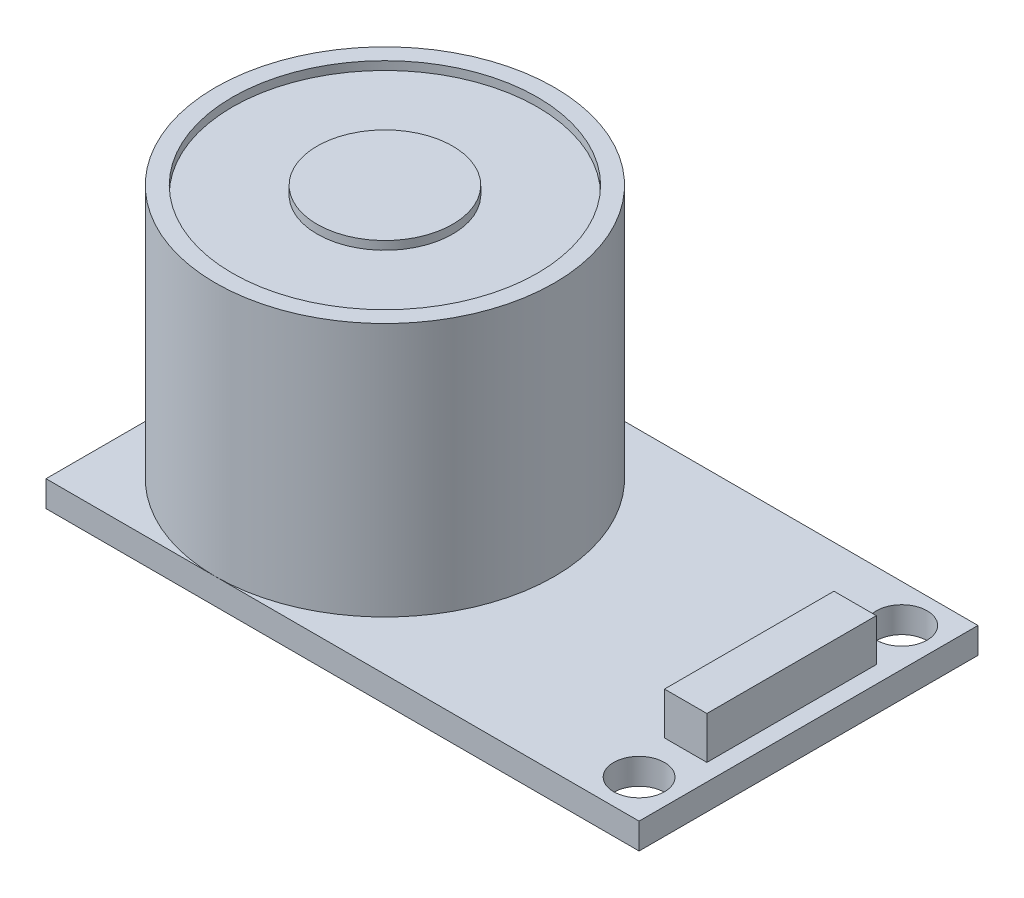
ISO-10303-21;
HEADER;
FILE_DESCRIPTION(('STEP AP214'),'2;1');
FILE_NAME('part.step','',(''),(''),'','','');
FILE_SCHEMA(('AUTOMOTIVE_DESIGN { 1 0 10303 214 1 1 1 1 }'));
ENDSEC;
DATA;
#1=APPLICATION_CONTEXT('core data for automotive mechanical design processes');
#2=APPLICATION_PROTOCOL_DEFINITION('international standard','automotive_design',2000,#1);
#3=PRODUCT_CONTEXT('',#1,'mechanical');
#4=PRODUCT('Part','Part','',(#3));
#5=PRODUCT_RELATED_PRODUCT_CATEGORY('part','',(#4));
#6=PRODUCT_DEFINITION_FORMATION('','',#4);
#7=PRODUCT_DEFINITION_CONTEXT('part definition',#1,'design');
#8=PRODUCT_DEFINITION('design','',#6,#7);
#9=PRODUCT_DEFINITION_SHAPE('','',#8);
#10=(LENGTH_UNIT() NAMED_UNIT(*) SI_UNIT(.MILLI.,.METRE.));
#11=(NAMED_UNIT(*) PLANE_ANGLE_UNIT() SI_UNIT($,.RADIAN.));
#12=(NAMED_UNIT(*) SI_UNIT($,.STERADIAN.) SOLID_ANGLE_UNIT());
#13=UNCERTAINTY_MEASURE_WITH_UNIT(LENGTH_MEASURE(1.E-05),#10,'distance_accuracy_value','');
#14=(GEOMETRIC_REPRESENTATION_CONTEXT(3) GLOBAL_UNCERTAINTY_ASSIGNED_CONTEXT((#13)) GLOBAL_UNIT_ASSIGNED_CONTEXT((#10,
#11,#12)) REPRESENTATION_CONTEXT('',''));
#15=CARTESIAN_POINT('',(0.,0.,0.));
#16=DIRECTION('',(0.,0.,1.));
#17=DIRECTION('',(1.,0.,0.));
#18=AXIS2_PLACEMENT_3D('',#15,#16,#17);
#19=CARTESIAN_POINT('',(0.,1.53,0.));
#20=DIRECTION('',(0.,-1.,0.));
#21=DIRECTION('',(0.,0.,-1.));
#22=AXIS2_PLACEMENT_3D('',#19,#20,#21);
#23=PLANE('',#22);
#24=CARTESIAN_POINT('',(32.75,1.53,-2.25));
#25=DIRECTION('',(0.,1.,0.));
#26=DIRECTION('',(0.,0.,-1.));
#27=AXIS2_PLACEMENT_3D('',#24,#25,#26);
#28=CIRCLE('',#27,1.5);
#29=CARTESIAN_POINT('',(32.75,1.53,-3.75));
#30=VERTEX_POINT('',#29);
#31=EDGE_CURVE('E171',#30,#30,#28,.T.);
#32=ORIENTED_EDGE('',*,*,#31,.F.);
#33=EDGE_LOOP('',(#32));
#34=FACE_BOUND('',#33,.T.);
#35=CARTESIAN_POINT('',(32.75,1.53,-17.75));
#36=DIRECTION('',(0.,1.,0.));
#37=DIRECTION('',(0.,0.,1.));
#38=AXIS2_PLACEMENT_3D('',#35,#36,#37);
#39=CIRCLE('',#38,1.5);
#40=CARTESIAN_POINT('',(32.75,1.53,-16.25));
#41=VERTEX_POINT('',#40);
#42=EDGE_CURVE('E177',#41,#41,#39,.T.);
#43=ORIENTED_EDGE('',*,*,#42,.F.);
#44=EDGE_LOOP('',(#43));
#45=FACE_BOUND('',#44,.T.);
#46=CARTESIAN_POINT('',(10.,1.53,-10.));
#47=DIRECTION('',(0.,1.,0.));
#48=DIRECTION('',(0.,0.,1.));
#49=AXIS2_PLACEMENT_3D('',#46,#47,#48);
#50=CIRCLE('',#49,10.);
#51=CARTESIAN_POINT('',(10.,1.53,0.));
#52=VERTEX_POINT('',#51);
#53=CARTESIAN_POINT('',(10.,1.53,-20.));
#54=VERTEX_POINT('',#53);
#55=EDGE_CURVE('E62',#52,#54,#50,.T.);
#56=ORIENTED_EDGE('',*,*,#55,.F.);
#57=DIRECTION('',(1.,0.,0.));
#58=VECTOR('',#57,1.);
#59=CARTESIAN_POINT('',(0.,1.53,0.));
#60=LINE('',#59,#58);
#61=CARTESIAN_POINT('',(35.,1.53,0.));
#62=VERTEX_POINT('',#61);
#63=EDGE_CURVE('E186',#52,#62,#60,.T.);
#64=ORIENTED_EDGE('',*,*,#63,.T.);
#65=DIRECTION('',(0.,0.,-1.));
#66=VECTOR('',#65,1.);
#67=CARTESIAN_POINT('',(35.,1.53,0.));
#68=LINE('',#67,#66);
#69=CARTESIAN_POINT('',(35.,1.53,-20.));
#70=VERTEX_POINT('',#69);
#71=EDGE_CURVE('E190',#62,#70,#68,.T.);
#72=ORIENTED_EDGE('',*,*,#71,.T.);
#73=DIRECTION('',(-1.,0.,0.));
#74=VECTOR('',#73,1.);
#75=CARTESIAN_POINT('',(0.,1.53,-20.));
#76=LINE('',#75,#74);
#77=EDGE_CURVE('E193',#70,#54,#76,.T.);
#78=ORIENTED_EDGE('',*,*,#77,.T.);
#79=EDGE_LOOP('',(#56,#64,#72,#78));
#80=FACE_BOUND('',#79,.T.);
#81=DIRECTION('',(0.,0.,-1.));
#82=VECTOR('',#81,1.);
#83=CARTESIAN_POINT('',(34.,1.53,-5.));
#84=LINE('',#83,#82);
#85=CARTESIAN_POINT('',(34.,1.53,-5.));
#86=VERTEX_POINT('',#85);
#87=CARTESIAN_POINT('',(34.,1.53,-15.));
#88=VERTEX_POINT('',#87);
#89=EDGE_CURVE('E148',#86,#88,#84,.T.);
#90=ORIENTED_EDGE('',*,*,#89,.F.);
#91=DIRECTION('',(1.,0.,0.));
#92=VECTOR('',#91,1.);
#93=CARTESIAN_POINT('',(31.5,1.53,-5.));
#94=LINE('',#93,#92);
#95=CARTESIAN_POINT('',(31.5,1.53,-5.));
#96=VERTEX_POINT('',#95);
#97=EDGE_CURVE('E145',#96,#86,#94,.T.);
#98=ORIENTED_EDGE('',*,*,#97,.F.);
#99=DIRECTION('',(0.,0.,1.));
#100=VECTOR('',#99,1.);
#101=CARTESIAN_POINT('',(31.5,1.53,-5.));
#102=LINE('',#101,#100);
#103=CARTESIAN_POINT('',(31.5,1.53,-15.));
#104=VERTEX_POINT('',#103);
#105=EDGE_CURVE('E74',#104,#96,#102,.T.);
#106=ORIENTED_EDGE('',*,*,#105,.F.);
#107=DIRECTION('',(-1.,0.,0.));
#108=VECTOR('',#107,1.);
#109=CARTESIAN_POINT('',(31.5,1.53,-15.));
#110=LINE('',#109,#108);
#111=EDGE_CURVE('E69',#88,#104,#110,.T.);
#112=ORIENTED_EDGE('',*,*,#111,.F.);
#113=EDGE_LOOP('',(#90,#98,#106,#112));
#114=FACE_BOUND('',#113,.T.);
#115=ADVANCED_FACE('F51',(#34,#45,#80,#114),#23,.F.);
#116=CARTESIAN_POINT('',(0.,1.53,-10.));
#117=VERTEX_POINT('',#116);
#118=EDGE_CURVE('E11',#54,#117,#50,.T.);
#119=ORIENTED_EDGE('',*,*,#118,.F.);
#120=CARTESIAN_POINT('',(0.,1.53,-20.));
#121=VERTEX_POINT('',#120);
#122=EDGE_CURVE('E192',#54,#121,#76,.T.);
#123=ORIENTED_EDGE('',*,*,#122,.T.);
#124=DIRECTION('',(0.,0.,1.));
#125=VECTOR('',#124,1.);
#126=CARTESIAN_POINT('',(0.,1.53,0.));
#127=LINE('',#126,#125);
#128=EDGE_CURVE('E183',#121,#117,#127,.T.);
#129=ORIENTED_EDGE('',*,*,#128,.T.);
#130=EDGE_LOOP('',(#119,#123,#129));
#131=FACE_BOUND('',#130,.T.);
#132=ADVANCED_FACE('F230',(#131),#23,.F.);
#133=EDGE_CURVE('E60',#117,#52,#50,.T.);
#134=ORIENTED_EDGE('',*,*,#133,.F.);
#135=CARTESIAN_POINT('',(0.,1.53,0.));
#136=VERTEX_POINT('',#135);
#137=EDGE_CURVE('E187',#117,#136,#127,.T.);
#138=ORIENTED_EDGE('',*,*,#137,.T.);
#139=EDGE_CURVE('E188',#136,#52,#60,.T.);
#140=ORIENTED_EDGE('',*,*,#139,.T.);
#141=EDGE_LOOP('',(#134,#138,#140));
#142=FACE_BOUND('',#141,.T.);
#143=ADVANCED_FACE('F225',(#142),#23,.F.);
#144=CARTESIAN_POINT('',(0.,0.,0.));
#145=DIRECTION('',(0.,-1.,0.));
#146=DIRECTION('',(0.,0.,-1.));
#147=AXIS2_PLACEMENT_3D('',#144,#145,#146);
#148=PLANE('',#147);
#149=CARTESIAN_POINT('',(32.75,0.,-17.75));
#150=DIRECTION('',(0.,1.,0.));
#151=DIRECTION('',(0.,0.,1.));
#152=AXIS2_PLACEMENT_3D('',#149,#150,#151);
#153=CIRCLE('',#152,1.5);
#154=CARTESIAN_POINT('',(32.75,0.,-16.25));
#155=VERTEX_POINT('',#154);
#156=EDGE_CURVE('E174',#155,#155,#153,.T.);
#157=ORIENTED_EDGE('',*,*,#156,.T.);
#158=EDGE_LOOP('',(#157));
#159=FACE_BOUND('',#158,.T.);
#160=DIRECTION('',(0.,0.,1.));
#161=VECTOR('',#160,1.);
#162=CARTESIAN_POINT('',(0.,0.,0.));
#163=LINE('',#162,#161);
#164=CARTESIAN_POINT('',(0.,0.,-20.));
#165=VERTEX_POINT('',#164);
#166=CARTESIAN_POINT('',(0.,0.,0.));
#167=VERTEX_POINT('',#166);
#168=EDGE_CURVE('E180',#165,#167,#163,.T.);
#169=ORIENTED_EDGE('',*,*,#168,.F.);
#170=DIRECTION('',(-1.,0.,0.));
#171=VECTOR('',#170,1.);
#172=CARTESIAN_POINT('',(0.,0.,-20.));
#173=LINE('',#172,#171);
#174=CARTESIAN_POINT('',(35.,0.,-20.));
#175=VERTEX_POINT('',#174);
#176=EDGE_CURVE('E203',#175,#165,#173,.T.);
#177=ORIENTED_EDGE('',*,*,#176,.F.);
#178=DIRECTION('',(0.,0.,-1.));
#179=VECTOR('',#178,1.);
#180=CARTESIAN_POINT('',(35.,0.,0.));
#181=LINE('',#180,#179);
#182=CARTESIAN_POINT('',(35.,0.,0.));
#183=VERTEX_POINT('',#182);
#184=EDGE_CURVE('E201',#183,#175,#181,.T.);
#185=ORIENTED_EDGE('',*,*,#184,.F.);
#186=DIRECTION('',(1.,0.,0.));
#187=VECTOR('',#186,1.);
#188=CARTESIAN_POINT('',(0.,0.,0.));
#189=LINE('',#188,#187);
#190=EDGE_CURVE('E199',#167,#183,#189,.T.);
#191=ORIENTED_EDGE('',*,*,#190,.F.);
#192=EDGE_LOOP('',(#169,#177,#185,#191));
#193=FACE_BOUND('',#192,.T.);
#194=CARTESIAN_POINT('',(32.75,0.,-2.25));
#195=DIRECTION('',(0.,1.,0.));
#196=DIRECTION('',(0.,0.,-1.));
#197=AXIS2_PLACEMENT_3D('',#194,#195,#196);
#198=CIRCLE('',#197,1.5);
#199=CARTESIAN_POINT('',(32.75,0.,-3.75));
#200=VERTEX_POINT('',#199);
#201=EDGE_CURVE('E168',#200,#200,#198,.T.);
#202=ORIENTED_EDGE('',*,*,#201,.T.);
#203=EDGE_LOOP('',(#202));
#204=FACE_BOUND('',#203,.T.);
#205=ADVANCED_FACE('F239',(#159,#193,#204),#148,.T.);
#206=CARTESIAN_POINT('',(0.,1.53,0.));
#207=DIRECTION('',(1.,0.,0.));
#208=DIRECTION('',(0.,0.,-1.));
#209=AXIS2_PLACEMENT_3D('',#206,#207,#208);
#210=PLANE('',#209);
#211=ORIENTED_EDGE('',*,*,#168,.T.);
#212=DIRECTION('',(0.,-1.,0.));
#213=VECTOR('',#212,1.);
#214=CARTESIAN_POINT('',(0.,1.53,0.));
#215=LINE('',#214,#213);
#216=EDGE_CURVE('E55',#136,#167,#215,.T.);
#217=ORIENTED_EDGE('',*,*,#216,.F.);
#218=ORIENTED_EDGE('',*,*,#137,.F.);
#219=ORIENTED_EDGE('',*,*,#128,.F.);
#220=DIRECTION('',(0.,-1.,0.));
#221=VECTOR('',#220,1.);
#222=CARTESIAN_POINT('',(0.,1.53,-20.));
#223=LINE('',#222,#221);
#224=EDGE_CURVE('E196',#121,#165,#223,.T.);
#225=ORIENTED_EDGE('',*,*,#224,.T.);
#226=EDGE_LOOP('',(#211,#217,#218,#219,#225));
#227=FACE_BOUND('',#226,.T.);
#228=ADVANCED_FACE('F53',(#227),#210,.F.);
#229=CARTESIAN_POINT('',(0.,1.53,0.));
#230=DIRECTION('',(0.,0.,-1.));
#231=DIRECTION('',(-1.,0.,0.));
#232=AXIS2_PLACEMENT_3D('',#229,#230,#231);
#233=PLANE('',#232);
#234=ORIENTED_EDGE('',*,*,#190,.T.);
#235=DIRECTION('',(0.,-1.,0.));
#236=VECTOR('',#235,1.);
#237=CARTESIAN_POINT('',(35.,1.53,0.));
#238=LINE('',#237,#236);
#239=EDGE_CURVE('E209',#62,#183,#238,.T.);
#240=ORIENTED_EDGE('',*,*,#239,.F.);
#241=ORIENTED_EDGE('',*,*,#63,.F.);
#242=ORIENTED_EDGE('',*,*,#139,.F.);
#243=ORIENTED_EDGE('',*,*,#216,.T.);
#244=EDGE_LOOP('',(#234,#240,#241,#242,#243));
#245=FACE_BOUND('',#244,.T.);
#246=ADVANCED_FACE('F241',(#245),#233,.F.);
#247=CARTESIAN_POINT('',(35.,1.53,0.));
#248=DIRECTION('',(-1.,0.,0.));
#249=DIRECTION('',(0.,0.,1.));
#250=AXIS2_PLACEMENT_3D('',#247,#248,#249);
#251=PLANE('',#250);
#252=ORIENTED_EDGE('',*,*,#184,.T.);
#253=DIRECTION('',(0.,-1.,0.));
#254=VECTOR('',#253,1.);
#255=CARTESIAN_POINT('',(35.,1.53,-20.));
#256=LINE('',#255,#254);
#257=EDGE_CURVE('E207',#70,#175,#256,.T.);
#258=ORIENTED_EDGE('',*,*,#257,.F.);
#259=ORIENTED_EDGE('',*,*,#71,.F.);
#260=ORIENTED_EDGE('',*,*,#239,.T.);
#261=EDGE_LOOP('',(#252,#258,#259,#260));
#262=FACE_BOUND('',#261,.T.);
#263=ADVANCED_FACE('F243',(#262),#251,.F.);
#264=CARTESIAN_POINT('',(0.,1.53,-20.));
#265=DIRECTION('',(0.,0.,1.));
#266=DIRECTION('',(1.,0.,0.));
#267=AXIS2_PLACEMENT_3D('',#264,#265,#266);
#268=PLANE('',#267);
#269=ORIENTED_EDGE('',*,*,#176,.T.);
#270=ORIENTED_EDGE('',*,*,#224,.F.);
#271=ORIENTED_EDGE('',*,*,#122,.F.);
#272=ORIENTED_EDGE('',*,*,#77,.F.);
#273=ORIENTED_EDGE('',*,*,#257,.T.);
#274=EDGE_LOOP('',(#269,#270,#271,#272,#273));
#275=FACE_BOUND('',#274,.T.);
#276=ADVANCED_FACE('F235',(#275),#268,.F.);
#277=CARTESIAN_POINT('',(32.75,1.53,-17.75));
#278=DIRECTION('',(0.,-1.,0.));
#279=DIRECTION('',(0.,0.,-1.));
#280=AXIS2_PLACEMENT_3D('',#277,#278,#279);
#281=CYLINDRICAL_SURFACE('',#280,1.5);
#282=ORIENTED_EDGE('',*,*,#42,.T.);
#283=EDGE_LOOP('',(#282));
#284=FACE_BOUND('',#283,.T.);
#285=ORIENTED_EDGE('',*,*,#156,.F.);
#286=EDGE_LOOP('',(#285));
#287=FACE_BOUND('',#286,.T.);
#288=ADVANCED_FACE('F298',(#284,#287),#281,.F.);
#289=CARTESIAN_POINT('',(32.75,1.53,-2.25));
#290=DIRECTION('',(0.,-1.,0.));
#291=DIRECTION('',(0.,0.,-1.));
#292=AXIS2_PLACEMENT_3D('',#289,#290,#291);
#293=CYLINDRICAL_SURFACE('',#292,1.5);
#294=ORIENTED_EDGE('',*,*,#31,.T.);
#295=EDGE_LOOP('',(#294));
#296=FACE_BOUND('',#295,.T.);
#297=ORIENTED_EDGE('',*,*,#201,.F.);
#298=EDGE_LOOP('',(#297));
#299=FACE_BOUND('',#298,.T.);
#300=ADVANCED_FACE('F294',(#296,#299),#293,.F.);
#301=CARTESIAN_POINT('',(10.,16.53,-10.));
#302=DIRECTION('',(0.,-1.,0.));
#303=DIRECTION('',(0.,0.,-1.));
#304=AXIS2_PLACEMENT_3D('',#301,#302,#303);
#305=CYLINDRICAL_SURFACE('',#304,10.);
#306=CARTESIAN_POINT('',(10.,16.53,-10.));
#307=DIRECTION('',(0.,1.,0.));
#308=DIRECTION('',(0.,0.,1.));
#309=AXIS2_PLACEMENT_3D('',#306,#307,#308);
#310=CIRCLE('',#309,10.);
#311=CARTESIAN_POINT('',(10.,16.53,0.));
#312=VERTEX_POINT('',#311);
#313=EDGE_CURVE('E166',#312,#312,#310,.T.);
#314=ORIENTED_EDGE('',*,*,#313,.F.);
#315=EDGE_LOOP('',(#314));
#316=FACE_BOUND('',#315,.T.);
#317=ORIENTED_EDGE('',*,*,#55,.T.);
#318=ORIENTED_EDGE('',*,*,#118,.T.);
#319=ORIENTED_EDGE('',*,*,#133,.T.);
#320=EDGE_LOOP('',(#317,#318,#319));
#321=FACE_BOUND('',#320,.T.);
#322=ADVANCED_FACE('F221',(#316,#321),#305,.T.);
#323=CARTESIAN_POINT('',(10.,16.53,-10.));
#324=DIRECTION('',(0.,1.,0.));
#325=DIRECTION('',(0.,0.,1.));
#326=AXIS2_PLACEMENT_3D('',#323,#324,#325);
#327=PLANE('',#326);
#328=CARTESIAN_POINT('',(10.,16.53,-10.));
#329=DIRECTION('',(0.,1.,0.));
#330=DIRECTION('',(0.,0.,1.));
#331=AXIS2_PLACEMENT_3D('',#328,#329,#330);
#332=CIRCLE('',#331,9.);
#333=CARTESIAN_POINT('',(10.,16.53,-1.));
#334=VERTEX_POINT('',#333);
#335=EDGE_CURVE('E159',#334,#334,#332,.T.);
#336=ORIENTED_EDGE('',*,*,#335,.F.);
#337=EDGE_LOOP('',(#336));
#338=FACE_BOUND('',#337,.T.);
#339=ORIENTED_EDGE('',*,*,#313,.T.);
#340=EDGE_LOOP('',(#339));
#341=FACE_BOUND('',#340,.T.);
#342=ADVANCED_FACE('F287',(#338,#341),#327,.T.);
#343=CARTESIAN_POINT('',(10.,16.03,-10.));
#344=DIRECTION('',(0.,1.,0.));
#345=DIRECTION('',(0.,0.,1.));
#346=AXIS2_PLACEMENT_3D('',#343,#344,#345);
#347=CYLINDRICAL_SURFACE('',#346,9.);
#348=CARTESIAN_POINT('',(10.,16.03,-10.));
#349=DIRECTION('',(0.,1.,0.));
#350=DIRECTION('',(0.,0.,1.));
#351=AXIS2_PLACEMENT_3D('',#348,#349,#350);
#352=CIRCLE('',#351,9.);
#353=CARTESIAN_POINT('',(10.,16.03,-1.));
#354=VERTEX_POINT('',#353);
#355=EDGE_CURVE('E161',#354,#354,#352,.T.);
#356=ORIENTED_EDGE('',*,*,#355,.F.);
#357=EDGE_LOOP('',(#356));
#358=FACE_BOUND('',#357,.T.);
#359=ORIENTED_EDGE('',*,*,#335,.T.);
#360=EDGE_LOOP('',(#359));
#361=FACE_BOUND('',#360,.T.);
#362=ADVANCED_FACE('F283',(#358,#361),#347,.F.);
#363=CARTESIAN_POINT('',(10.,16.03,-10.));
#364=DIRECTION('',(0.,1.,0.));
#365=DIRECTION('',(0.,0.,1.));
#366=AXIS2_PLACEMENT_3D('',#363,#364,#365);
#367=PLANE('',#366);
#368=CARTESIAN_POINT('',(10.,16.03,-10.));
#369=DIRECTION('',(0.,1.,0.));
#370=DIRECTION('',(0.,0.,1.));
#371=AXIS2_PLACEMENT_3D('',#368,#369,#370);
#372=CIRCLE('',#371,4.);
#373=CARTESIAN_POINT('',(10.,16.03,-6.));
#374=VERTEX_POINT('',#373);
#375=EDGE_CURVE('E152',#374,#374,#372,.T.);
#376=ORIENTED_EDGE('',*,*,#375,.F.);
#377=EDGE_LOOP('',(#376));
#378=FACE_BOUND('',#377,.T.);
#379=ORIENTED_EDGE('',*,*,#355,.T.);
#380=EDGE_LOOP('',(#379));
#381=FACE_BOUND('',#380,.T.);
#382=ADVANCED_FACE('F279',(#378,#381),#367,.T.);
#383=CARTESIAN_POINT('',(10.,16.03,-10.));
#384=DIRECTION('',(0.,1.,0.));
#385=DIRECTION('',(0.,0.,1.));
#386=AXIS2_PLACEMENT_3D('',#383,#384,#385);
#387=CYLINDRICAL_SURFACE('',#386,4.);
#388=ORIENTED_EDGE('',*,*,#375,.T.);
#389=EDGE_LOOP('',(#388));
#390=FACE_BOUND('',#389,.T.);
#391=CARTESIAN_POINT('',(10.,16.53,-10.));
#392=DIRECTION('',(0.,1.,0.));
#393=DIRECTION('',(0.,0.,1.));
#394=AXIS2_PLACEMENT_3D('',#391,#392,#393);
#395=CIRCLE('',#394,4.);
#396=CARTESIAN_POINT('',(10.,16.53,-6.));
#397=VERTEX_POINT('',#396);
#398=EDGE_CURVE('E149',#397,#397,#395,.T.);
#399=ORIENTED_EDGE('',*,*,#398,.F.);
#400=EDGE_LOOP('',(#399));
#401=FACE_BOUND('',#400,.T.);
#402=ADVANCED_FACE('F276',(#390,#401),#387,.T.);
#403=ORIENTED_EDGE('',*,*,#398,.T.);
#404=EDGE_LOOP('',(#403));
#405=FACE_BOUND('',#404,.T.);
#406=ADVANCED_FACE('F275',(#405),#327,.T.);
#407=CARTESIAN_POINT('',(34.,4.03,-5.));
#408=DIRECTION('',(-1.,0.,0.));
#409=DIRECTION('',(0.,0.,1.));
#410=AXIS2_PLACEMENT_3D('',#407,#408,#409);
#411=PLANE('',#410);
#412=ORIENTED_EDGE('',*,*,#89,.T.);
#413=DIRECTION('',(0.,-1.,0.));
#414=VECTOR('',#413,1.);
#415=CARTESIAN_POINT('',(34.,4.03,-15.));
#416=LINE('',#415,#414);
#417=CARTESIAN_POINT('',(34.,4.03,-15.));
#418=VERTEX_POINT('',#417);
#419=EDGE_CURVE('E129',#418,#88,#416,.T.);
#420=ORIENTED_EDGE('',*,*,#419,.F.);
#421=DIRECTION('',(0.,0.,-1.));
#422=VECTOR('',#421,1.);
#423=CARTESIAN_POINT('',(34.,4.03,-5.));
#424=LINE('',#423,#422);
#425=CARTESIAN_POINT('',(34.,4.03,-5.));
#426=VERTEX_POINT('',#425);
#427=EDGE_CURVE('E136',#426,#418,#424,.T.);
#428=ORIENTED_EDGE('',*,*,#427,.F.);
#429=DIRECTION('',(0.,-1.,0.));
#430=VECTOR('',#429,1.);
#431=CARTESIAN_POINT('',(34.,4.03,-5.));
#432=LINE('',#431,#430);
#433=EDGE_CURVE('E253',#426,#86,#432,.T.);
#434=ORIENTED_EDGE('',*,*,#433,.T.);
#435=EDGE_LOOP('',(#412,#420,#428,#434));
#436=FACE_BOUND('',#435,.T.);
#437=ADVANCED_FACE('F147',(#436),#411,.F.);
#438=CARTESIAN_POINT('',(31.5,4.03,-15.));
#439=DIRECTION('',(0.,0.,1.));
#440=DIRECTION('',(1.,0.,0.));
#441=AXIS2_PLACEMENT_3D('',#438,#439,#440);
#442=PLANE('',#441);
#443=ORIENTED_EDGE('',*,*,#111,.T.);
#444=DIRECTION('',(0.,-1.,0.));
#445=VECTOR('',#444,1.);
#446=CARTESIAN_POINT('',(31.5,4.03,-15.));
#447=LINE('',#446,#445);
#448=CARTESIAN_POINT('',(31.5,4.03,-15.));
#449=VERTEX_POINT('',#448);
#450=EDGE_CURVE('E132',#449,#104,#447,.T.);
#451=ORIENTED_EDGE('',*,*,#450,.F.);
#452=DIRECTION('',(-1.,0.,0.));
#453=VECTOR('',#452,1.);
#454=CARTESIAN_POINT('',(31.5,4.03,-15.));
#455=LINE('',#454,#453);
#456=EDGE_CURVE('E125',#418,#449,#455,.T.);
#457=ORIENTED_EDGE('',*,*,#456,.F.);
#458=ORIENTED_EDGE('',*,*,#419,.T.);
#459=EDGE_LOOP('',(#443,#451,#457,#458));
#460=FACE_BOUND('',#459,.T.);
#461=ADVANCED_FACE('F127',(#460),#442,.F.);
#462=CARTESIAN_POINT('',(31.5,4.03,-5.));
#463=DIRECTION('',(1.,0.,0.));
#464=DIRECTION('',(0.,0.,-1.));
#465=AXIS2_PLACEMENT_3D('',#462,#463,#464);
#466=PLANE('',#465);
#467=ORIENTED_EDGE('',*,*,#105,.T.);
#468=DIRECTION('',(0.,-1.,0.));
#469=VECTOR('',#468,1.);
#470=CARTESIAN_POINT('',(31.5,4.03,-5.));
#471=LINE('',#470,#469);
#472=CARTESIAN_POINT('',(31.5,4.03,-5.));
#473=VERTEX_POINT('',#472);
#474=EDGE_CURVE('E154',#473,#96,#471,.T.);
#475=ORIENTED_EDGE('',*,*,#474,.F.);
#476=DIRECTION('',(0.,0.,1.));
#477=VECTOR('',#476,1.);
#478=CARTESIAN_POINT('',(31.5,4.03,-5.));
#479=LINE('',#478,#477);
#480=EDGE_CURVE('E135',#449,#473,#479,.T.);
#481=ORIENTED_EDGE('',*,*,#480,.F.);
#482=ORIENTED_EDGE('',*,*,#450,.T.);
#483=EDGE_LOOP('',(#467,#475,#481,#482));
#484=FACE_BOUND('',#483,.T.);
#485=ADVANCED_FACE('F262',(#484),#466,.F.);
#486=CARTESIAN_POINT('',(31.5,4.03,-5.));
#487=DIRECTION('',(0.,0.,-1.));
#488=DIRECTION('',(-1.,0.,0.));
#489=AXIS2_PLACEMENT_3D('',#486,#487,#488);
#490=PLANE('',#489);
#491=ORIENTED_EDGE('',*,*,#97,.T.);
#492=ORIENTED_EDGE('',*,*,#433,.F.);
#493=DIRECTION('',(1.,0.,0.));
#494=VECTOR('',#493,1.);
#495=CARTESIAN_POINT('',(31.5,4.03,-5.));
#496=LINE('',#495,#494);
#497=EDGE_CURVE('E141',#473,#426,#496,.T.);
#498=ORIENTED_EDGE('',*,*,#497,.F.);
#499=ORIENTED_EDGE('',*,*,#474,.T.);
#500=EDGE_LOOP('',(#491,#492,#498,#499));
#501=FACE_BOUND('',#500,.T.);
#502=ADVANCED_FACE('F252',(#501),#490,.F.);
#503=CARTESIAN_POINT('',(0.,4.03,0.));
#504=DIRECTION('',(0.,-1.,0.));
#505=DIRECTION('',(0.,0.,-1.));
#506=AXIS2_PLACEMENT_3D('',#503,#504,#505);
#507=PLANE('',#506);
#508=ORIENTED_EDGE('',*,*,#427,.T.);
#509=ORIENTED_EDGE('',*,*,#456,.T.);
#510=ORIENTED_EDGE('',*,*,#480,.T.);
#511=ORIENTED_EDGE('',*,*,#497,.T.);
#512=EDGE_LOOP('',(#508,#509,#510,#511));
#513=FACE_BOUND('',#512,.T.);
#514=ADVANCED_FACE('F139',(#513),#507,.F.);
#515=CLOSED_SHELL('',(#115,#132,#143,#205,#228,#246,#263,#276,#288,#300,#322,#342,#362,#382,
#402,#406,#437,#461,#485,#502,#514));
#516=MANIFOLD_SOLID_BREP('B2',#515);
#517=ADVANCED_BREP_SHAPE_REPRESENTATION('',(#18,#516),#14);
#518=SHAPE_DEFINITION_REPRESENTATION(#9,#517);
ENDSEC;
END-ISO-10303-21;
